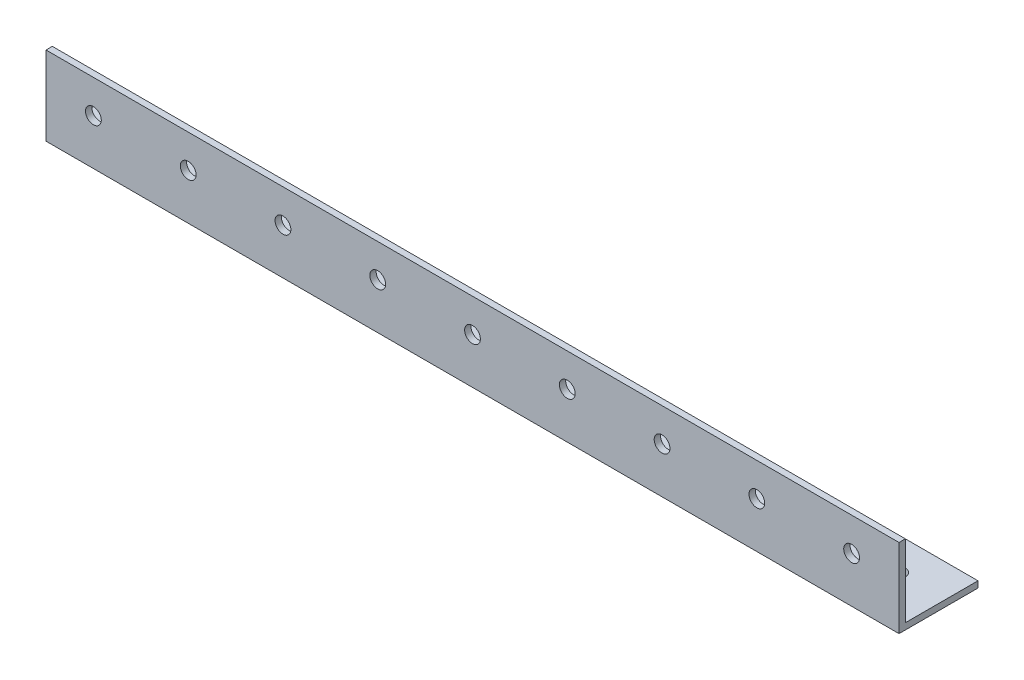
ISO-10303-21;
HEADER;
FILE_DESCRIPTION(('STEP AP214'),'2;1');
FILE_NAME('part.step','',(''),(''),'','','');
FILE_SCHEMA(('AUTOMOTIVE_DESIGN { 1 0 10303 214 1 1 1 1 }'));
ENDSEC;
DATA;
#1=APPLICATION_CONTEXT('core data for automotive mechanical design processes');
#2=APPLICATION_PROTOCOL_DEFINITION('international standard','automotive_design',2000,#1);
#3=PRODUCT_CONTEXT('',#1,'mechanical');
#4=PRODUCT('Part','Part','',(#3));
#5=PRODUCT_RELATED_PRODUCT_CATEGORY('part','',(#4));
#6=PRODUCT_DEFINITION_FORMATION('','',#4);
#7=PRODUCT_DEFINITION_CONTEXT('part definition',#1,'design');
#8=PRODUCT_DEFINITION('design','',#6,#7);
#9=PRODUCT_DEFINITION_SHAPE('','',#8);
#10=(LENGTH_UNIT() NAMED_UNIT(*) SI_UNIT(.MILLI.,.METRE.));
#11=(NAMED_UNIT(*) PLANE_ANGLE_UNIT() SI_UNIT($,.RADIAN.));
#12=(NAMED_UNIT(*) SI_UNIT($,.STERADIAN.) SOLID_ANGLE_UNIT());
#13=UNCERTAINTY_MEASURE_WITH_UNIT(LENGTH_MEASURE(1.E-05),#10,'distance_accuracy_value','');
#14=(GEOMETRIC_REPRESENTATION_CONTEXT(3) GLOBAL_UNCERTAINTY_ASSIGNED_CONTEXT((#13)) GLOBAL_UNIT_ASSIGNED_CONTEXT((#10,
#11,#12)) REPRESENTATION_CONTEXT('',''));
#15=CARTESIAN_POINT('',(0.,0.,0.));
#16=DIRECTION('',(0.,0.,1.));
#17=DIRECTION('',(1.,0.,0.));
#18=AXIS2_PLACEMENT_3D('',#15,#16,#17);
#19=CARTESIAN_POINT('',(539.999999999999,0.,0.));
#20=DIRECTION('',(0.,1.,0.));
#21=DIRECTION('',(0.,0.,1.));
#22=AXIS2_PLACEMENT_3D('',#19,#20,#21);
#23=PLANE('',#22);
#24=CARTESIAN_POINT('',(30.,0.,-29.));
#25=DIRECTION('',(0.,-1.,0.));
#26=DIRECTION('',(0.,0.,-1.));
#27=AXIS2_PLACEMENT_3D('',#24,#25,#26);
#28=CIRCLE('',#27,5.);
#29=CARTESIAN_POINT('',(30.,0.,-34.));
#30=VERTEX_POINT('',#29);
#31=EDGE_CURVE('E142',#30,#30,#28,.T.);
#32=ORIENTED_EDGE('',*,*,#31,.F.);
#33=EDGE_LOOP('',(#32));
#34=FACE_BOUND('',#33,.T.);
#35=CARTESIAN_POINT('',(90.,0.,-29.));
#36=DIRECTION('',(0.,-1.,0.));
#37=DIRECTION('',(0.,0.,-1.));
#38=AXIS2_PLACEMENT_3D('',#35,#36,#37);
#39=CIRCLE('',#38,5.);
#40=CARTESIAN_POINT('',(90.,0.,-34.));
#41=VERTEX_POINT('',#40);
#42=EDGE_CURVE('E258',#41,#41,#39,.T.);
#43=ORIENTED_EDGE('',*,*,#42,.F.);
#44=EDGE_LOOP('',(#43));
#45=FACE_BOUND('',#44,.T.);
#46=CARTESIAN_POINT('',(150.,0.,-29.));
#47=DIRECTION('',(0.,-1.,0.));
#48=DIRECTION('',(0.,0.,-1.));
#49=AXIS2_PLACEMENT_3D('',#46,#47,#48);
#50=CIRCLE('',#49,4.99999999999999);
#51=CARTESIAN_POINT('',(150.,0.,-34.));
#52=VERTEX_POINT('',#51);
#53=EDGE_CURVE('E262',#52,#52,#50,.T.);
#54=ORIENTED_EDGE('',*,*,#53,.F.);
#55=EDGE_LOOP('',(#54));
#56=FACE_BOUND('',#55,.T.);
#57=CARTESIAN_POINT('',(210.,0.,-29.));
#58=DIRECTION('',(0.,-1.,0.));
#59=DIRECTION('',(0.,0.,-1.));
#60=AXIS2_PLACEMENT_3D('',#57,#58,#59);
#61=CIRCLE('',#60,5.00000000000002);
#62=CARTESIAN_POINT('',(210.,0.,-34.));
#63=VERTEX_POINT('',#62);
#64=EDGE_CURVE('E266',#63,#63,#61,.T.);
#65=ORIENTED_EDGE('',*,*,#64,.F.);
#66=EDGE_LOOP('',(#65));
#67=FACE_BOUND('',#66,.T.);
#68=CARTESIAN_POINT('',(270.,0.,-29.));
#69=DIRECTION('',(0.,-1.,0.));
#70=DIRECTION('',(0.,0.,-1.));
#71=AXIS2_PLACEMENT_3D('',#68,#69,#70);
#72=CIRCLE('',#71,4.99999999999999);
#73=CARTESIAN_POINT('',(270.,0.,-34.));
#74=VERTEX_POINT('',#73);
#75=EDGE_CURVE('E270',#74,#74,#72,.T.);
#76=ORIENTED_EDGE('',*,*,#75,.F.);
#77=EDGE_LOOP('',(#76));
#78=FACE_BOUND('',#77,.T.);
#79=CARTESIAN_POINT('',(330.,0.,-29.));
#80=DIRECTION('',(0.,-1.,0.));
#81=DIRECTION('',(0.,0.,-1.));
#82=AXIS2_PLACEMENT_3D('',#79,#80,#81);
#83=CIRCLE('',#82,5.00000000000005);
#84=CARTESIAN_POINT('',(330.,0.,-34.));
#85=VERTEX_POINT('',#84);
#86=EDGE_CURVE('E274',#85,#85,#83,.T.);
#87=ORIENTED_EDGE('',*,*,#86,.F.);
#88=EDGE_LOOP('',(#87));
#89=FACE_BOUND('',#88,.T.);
#90=CARTESIAN_POINT('',(390.,0.,-29.));
#91=DIRECTION('',(0.,-1.,0.));
#92=DIRECTION('',(0.,0.,-1.));
#93=AXIS2_PLACEMENT_3D('',#90,#91,#92);
#94=CIRCLE('',#93,4.99999999999999);
#95=CARTESIAN_POINT('',(390.,0.,-34.));
#96=VERTEX_POINT('',#95);
#97=EDGE_CURVE('E278',#96,#96,#94,.T.);
#98=ORIENTED_EDGE('',*,*,#97,.F.);
#99=EDGE_LOOP('',(#98));
#100=FACE_BOUND('',#99,.T.);
#101=CARTESIAN_POINT('',(450.,0.,-29.));
#102=DIRECTION('',(0.,-1.,0.));
#103=DIRECTION('',(0.,0.,-1.));
#104=AXIS2_PLACEMENT_3D('',#101,#102,#103);
#105=CIRCLE('',#104,5.00000000000005);
#106=CARTESIAN_POINT('',(450.,0.,-34.));
#107=VERTEX_POINT('',#106);
#108=EDGE_CURVE('E282',#107,#107,#105,.T.);
#109=ORIENTED_EDGE('',*,*,#108,.F.);
#110=EDGE_LOOP('',(#109));
#111=FACE_BOUND('',#110,.T.);
#112=CARTESIAN_POINT('',(510.,0.,-29.));
#113=DIRECTION('',(0.,-1.,0.));
#114=DIRECTION('',(0.,0.,-1.));
#115=AXIS2_PLACEMENT_3D('',#112,#113,#114);
#116=CIRCLE('',#115,4.99999999999993);
#117=CARTESIAN_POINT('',(510.,0.,-33.9999999999999));
#118=VERTEX_POINT('',#117);
#119=EDGE_CURVE('E285',#118,#118,#116,.T.);
#120=ORIENTED_EDGE('',*,*,#119,.F.);
#121=EDGE_LOOP('',(#120));
#122=FACE_BOUND('',#121,.T.);
#123=DIRECTION('',(0.,0.,-1.));
#124=VECTOR('',#123,1.);
#125=CARTESIAN_POINT('',(0.,0.,0.));
#126=LINE('',#125,#124);
#127=CARTESIAN_POINT('',(0.,0.,0.));
#128=VERTEX_POINT('',#127);
#129=CARTESIAN_POINT('',(0.,0.,-50.));
#130=VERTEX_POINT('',#129);
#131=EDGE_CURVE('E120',#128,#130,#126,.T.);
#132=ORIENTED_EDGE('',*,*,#131,.T.);
#133=DIRECTION('',(-1.,0.,0.));
#134=VECTOR('',#133,1.);
#135=CARTESIAN_POINT('',(539.999999999999,0.,-50.));
#136=LINE('',#135,#134);
#137=CARTESIAN_POINT('',(539.999999999999,0.,-50.));
#138=VERTEX_POINT('',#137);
#139=EDGE_CURVE('E11',#138,#130,#136,.T.);
#140=ORIENTED_EDGE('',*,*,#139,.F.);
#141=DIRECTION('',(0.,0.,-1.));
#142=VECTOR('',#141,1.);
#143=CARTESIAN_POINT('',(539.999999999999,0.,0.));
#144=LINE('',#143,#142);
#145=CARTESIAN_POINT('',(539.999999999999,0.,0.));
#146=VERTEX_POINT('',#145);
#147=EDGE_CURVE('E85',#146,#138,#144,.T.);
#148=ORIENTED_EDGE('',*,*,#147,.F.);
#149=DIRECTION('',(-1.,0.,0.));
#150=VECTOR('',#149,1.);
#151=CARTESIAN_POINT('',(539.999999999999,0.,0.));
#152=LINE('',#151,#150);
#153=EDGE_CURVE('E116',#146,#128,#152,.T.);
#154=ORIENTED_EDGE('',*,*,#153,.T.);
#155=EDGE_LOOP('',(#132,#140,#148,#154));
#156=FACE_BOUND('',#155,.T.);
#157=ADVANCED_FACE('F37',(#34,#45,#56,#67,#78,#89,#100,#111,#122,#156),#23,.F.);
#158=CARTESIAN_POINT('',(539.999999999999,4.,-50.));
#159=DIRECTION('',(0.,0.,-1.));
#160=DIRECTION('',(-1.,0.,0.));
#161=AXIS2_PLACEMENT_3D('',#158,#159,#160);
#162=PLANE('',#161);
#163=DIRECTION('',(0.,-1.,0.));
#164=VECTOR('',#163,1.);
#165=CARTESIAN_POINT('',(0.,4.,-50.));
#166=LINE('',#165,#164);
#167=CARTESIAN_POINT('',(0.,4.,-50.));
#168=VERTEX_POINT('',#167);
#169=EDGE_CURVE('E123',#168,#130,#166,.T.);
#170=ORIENTED_EDGE('',*,*,#169,.F.);
#171=DIRECTION('',(-1.,0.,0.));
#172=VECTOR('',#171,1.);
#173=CARTESIAN_POINT('',(539.999999999999,4.,-50.));
#174=LINE('',#173,#172);
#175=CARTESIAN_POINT('',(539.999999999999,4.,-50.));
#176=VERTEX_POINT('',#175);
#177=EDGE_CURVE('E46',#176,#168,#174,.T.);
#178=ORIENTED_EDGE('',*,*,#177,.F.);
#179=DIRECTION('',(0.,-1.,0.));
#180=VECTOR('',#179,1.);
#181=CARTESIAN_POINT('',(539.999999999999,4.,-50.));
#182=LINE('',#181,#180);
#183=EDGE_CURVE('E222',#176,#138,#182,.T.);
#184=ORIENTED_EDGE('',*,*,#183,.T.);
#185=ORIENTED_EDGE('',*,*,#139,.T.);
#186=EDGE_LOOP('',(#170,#178,#184,#185));
#187=FACE_BOUND('',#186,.T.);
#188=ADVANCED_FACE('F246',(#187),#162,.T.);
#189=CARTESIAN_POINT('',(539.999999999999,4.,0.));
#190=DIRECTION('',(0.,1.,0.));
#191=DIRECTION('',(0.,0.,1.));
#192=AXIS2_PLACEMENT_3D('',#189,#190,#191);
#193=PLANE('',#192);
#194=CARTESIAN_POINT('',(30.,4.,-29.));
#195=DIRECTION('',(0.,1.,0.));
#196=DIRECTION('',(0.,0.,1.));
#197=AXIS2_PLACEMENT_3D('',#194,#195,#196);
#198=CIRCLE('',#197,5.);
#199=CARTESIAN_POINT('',(30.,4.,-24.));
#200=VERTEX_POINT('',#199);
#201=EDGE_CURVE('E40',#200,#200,#198,.T.);
#202=ORIENTED_EDGE('',*,*,#201,.F.);
#203=EDGE_LOOP('',(#202));
#204=FACE_BOUND('',#203,.T.);
#205=CARTESIAN_POINT('',(90.,4.,-29.));
#206=DIRECTION('',(0.,1.,0.));
#207=DIRECTION('',(0.,0.,1.));
#208=AXIS2_PLACEMENT_3D('',#205,#206,#207);
#209=CIRCLE('',#208,5.);
#210=CARTESIAN_POINT('',(90.,4.,-24.));
#211=VERTEX_POINT('',#210);
#212=EDGE_CURVE('E159',#211,#211,#209,.T.);
#213=ORIENTED_EDGE('',*,*,#212,.F.);
#214=EDGE_LOOP('',(#213));
#215=FACE_BOUND('',#214,.T.);
#216=CARTESIAN_POINT('',(150.,4.,-29.));
#217=DIRECTION('',(0.,1.,0.));
#218=DIRECTION('',(0.,0.,1.));
#219=AXIS2_PLACEMENT_3D('',#216,#217,#218);
#220=CIRCLE('',#219,4.99999999999999);
#221=CARTESIAN_POINT('',(150.,4.,-24.));
#222=VERTEX_POINT('',#221);
#223=EDGE_CURVE('E157',#222,#222,#220,.T.);
#224=ORIENTED_EDGE('',*,*,#223,.F.);
#225=EDGE_LOOP('',(#224));
#226=FACE_BOUND('',#225,.T.);
#227=CARTESIAN_POINT('',(210.,4.,-29.));
#228=DIRECTION('',(0.,1.,0.));
#229=DIRECTION('',(0.,0.,1.));
#230=AXIS2_PLACEMENT_3D('',#227,#228,#229);
#231=CIRCLE('',#230,5.00000000000002);
#232=CARTESIAN_POINT('',(210.,4.,-24.));
#233=VERTEX_POINT('',#232);
#234=EDGE_CURVE('E154',#233,#233,#231,.T.);
#235=ORIENTED_EDGE('',*,*,#234,.F.);
#236=EDGE_LOOP('',(#235));
#237=FACE_BOUND('',#236,.T.);
#238=CARTESIAN_POINT('',(270.,4.,-29.));
#239=DIRECTION('',(0.,1.,0.));
#240=DIRECTION('',(0.,0.,1.));
#241=AXIS2_PLACEMENT_3D('',#238,#239,#240);
#242=CIRCLE('',#241,4.99999999999999);
#243=CARTESIAN_POINT('',(270.,4.,-24.));
#244=VERTEX_POINT('',#243);
#245=EDGE_CURVE('E151',#244,#244,#242,.T.);
#246=ORIENTED_EDGE('',*,*,#245,.F.);
#247=EDGE_LOOP('',(#246));
#248=FACE_BOUND('',#247,.T.);
#249=CARTESIAN_POINT('',(330.,4.,-29.));
#250=DIRECTION('',(0.,1.,0.));
#251=DIRECTION('',(0.,0.,1.));
#252=AXIS2_PLACEMENT_3D('',#249,#250,#251);
#253=CIRCLE('',#252,5.00000000000005);
#254=CARTESIAN_POINT('',(330.,4.,-24.));
#255=VERTEX_POINT('',#254);
#256=EDGE_CURVE('E148',#255,#255,#253,.T.);
#257=ORIENTED_EDGE('',*,*,#256,.F.);
#258=EDGE_LOOP('',(#257));
#259=FACE_BOUND('',#258,.T.);
#260=CARTESIAN_POINT('',(390.,4.,-29.));
#261=DIRECTION('',(0.,1.,0.));
#262=DIRECTION('',(0.,0.,1.));
#263=AXIS2_PLACEMENT_3D('',#260,#261,#262);
#264=CIRCLE('',#263,4.99999999999999);
#265=CARTESIAN_POINT('',(390.,4.,-24.));
#266=VERTEX_POINT('',#265);
#267=EDGE_CURVE('E145',#266,#266,#264,.T.);
#268=ORIENTED_EDGE('',*,*,#267,.F.);
#269=EDGE_LOOP('',(#268));
#270=FACE_BOUND('',#269,.T.);
#271=CARTESIAN_POINT('',(450.,4.,-29.));
#272=DIRECTION('',(0.,1.,0.));
#273=DIRECTION('',(0.,0.,1.));
#274=AXIS2_PLACEMENT_3D('',#271,#272,#273);
#275=CIRCLE('',#274,5.00000000000005);
#276=CARTESIAN_POINT('',(450.,4.,-24.));
#277=VERTEX_POINT('',#276);
#278=EDGE_CURVE('E141',#277,#277,#275,.T.);
#279=ORIENTED_EDGE('',*,*,#278,.F.);
#280=EDGE_LOOP('',(#279));
#281=FACE_BOUND('',#280,.T.);
#282=CARTESIAN_POINT('',(510.,4.,-29.));
#283=DIRECTION('',(0.,1.,0.));
#284=DIRECTION('',(0.,0.,1.));
#285=AXIS2_PLACEMENT_3D('',#282,#283,#284);
#286=CIRCLE('',#285,4.99999999999993);
#287=CARTESIAN_POINT('',(510.,4.,-24.0000000000001));
#288=VERTEX_POINT('',#287);
#289=EDGE_CURVE('E138',#288,#288,#286,.T.);
#290=ORIENTED_EDGE('',*,*,#289,.F.);
#291=EDGE_LOOP('',(#290));
#292=FACE_BOUND('',#291,.T.);
#293=DIRECTION('',(0.,0.,-1.));
#294=VECTOR('',#293,1.);
#295=CARTESIAN_POINT('',(0.,4.,0.));
#296=LINE('',#295,#294);
#297=CARTESIAN_POINT('',(0.,4.,-4.));
#298=VERTEX_POINT('',#297);
#299=EDGE_CURVE('E127',#298,#168,#296,.T.);
#300=ORIENTED_EDGE('',*,*,#299,.F.);
#301=DIRECTION('',(-1.,0.,0.));
#302=VECTOR('',#301,1.);
#303=CARTESIAN_POINT('',(539.999999999999,4.,-4.));
#304=LINE('',#303,#302);
#305=CARTESIAN_POINT('',(539.999999999999,4.,-4.));
#306=VERTEX_POINT('',#305);
#307=EDGE_CURVE('E106',#306,#298,#304,.T.);
#308=ORIENTED_EDGE('',*,*,#307,.F.);
#309=DIRECTION('',(0.,0.,-1.));
#310=VECTOR('',#309,1.);
#311=CARTESIAN_POINT('',(539.999999999999,4.,0.));
#312=LINE('',#311,#310);
#313=EDGE_CURVE('E112',#306,#176,#312,.T.);
#314=ORIENTED_EDGE('',*,*,#313,.T.);
#315=ORIENTED_EDGE('',*,*,#177,.T.);
#316=EDGE_LOOP('',(#300,#308,#314,#315));
#317=FACE_BOUND('',#316,.T.);
#318=ADVANCED_FACE('F226',(#204,#215,#226,#237,#248,#259,#270,#281,#292,#317),#193,.T.);
#319=CARTESIAN_POINT('',(539.999999999999,0.,-4.));
#320=DIRECTION('',(0.,0.,-1.));
#321=DIRECTION('',(-1.,0.,0.));
#322=AXIS2_PLACEMENT_3D('',#319,#320,#321);
#323=PLANE('',#322);
#324=CARTESIAN_POINT('',(29.9999999999998,29.,-4.));
#325=DIRECTION('',(0.,0.,-1.));
#326=DIRECTION('',(-1.,0.,0.));
#327=AXIS2_PLACEMENT_3D('',#324,#325,#326);
#328=CIRCLE('',#327,4.99999999999998);
#329=CARTESIAN_POINT('',(24.9999999999998,29.,-4.));
#330=VERTEX_POINT('',#329);
#331=EDGE_CURVE('E124',#330,#330,#328,.T.);
#332=ORIENTED_EDGE('',*,*,#331,.F.);
#333=EDGE_LOOP('',(#332));
#334=FACE_BOUND('',#333,.T.);
#335=CARTESIAN_POINT('',(389.999999999999,29.,-4.));
#336=DIRECTION('',(0.,0.,-1.));
#337=DIRECTION('',(-1.,0.,0.));
#338=AXIS2_PLACEMENT_3D('',#335,#336,#337);
#339=CIRCLE('',#338,4.99999999999999);
#340=CARTESIAN_POINT('',(384.999999999999,29.,-4.));
#341=VERTEX_POINT('',#340);
#342=EDGE_CURVE('E216',#341,#341,#339,.T.);
#343=ORIENTED_EDGE('',*,*,#342,.F.);
#344=EDGE_LOOP('',(#343));
#345=FACE_BOUND('',#344,.T.);
#346=CARTESIAN_POINT('',(449.999999999999,29.,-4.));
#347=DIRECTION('',(0.,0.,-1.));
#348=DIRECTION('',(-1.,0.,0.));
#349=AXIS2_PLACEMENT_3D('',#346,#347,#348);
#350=CIRCLE('',#349,4.99999999999999);
#351=CARTESIAN_POINT('',(444.999999999999,29.,-4.));
#352=VERTEX_POINT('',#351);
#353=EDGE_CURVE('E213',#352,#352,#350,.T.);
#354=ORIENTED_EDGE('',*,*,#353,.F.);
#355=EDGE_LOOP('',(#354));
#356=FACE_BOUND('',#355,.T.);
#357=CARTESIAN_POINT('',(509.999999999999,29.,-4.));
#358=DIRECTION('',(0.,0.,-1.));
#359=DIRECTION('',(-1.,0.,0.));
#360=AXIS2_PLACEMENT_3D('',#357,#358,#359);
#361=CIRCLE('',#360,4.99999999999993);
#362=CARTESIAN_POINT('',(504.999999999999,29.,-4.));
#363=VERTEX_POINT('',#362);
#364=EDGE_CURVE('E210',#363,#363,#361,.T.);
#365=ORIENTED_EDGE('',*,*,#364,.F.);
#366=EDGE_LOOP('',(#365));
#367=FACE_BOUND('',#366,.T.);
#368=CARTESIAN_POINT('',(269.999999999999,29.,-4.));
#369=DIRECTION('',(0.,0.,-1.));
#370=DIRECTION('',(-1.,0.,0.));
#371=AXIS2_PLACEMENT_3D('',#368,#369,#370);
#372=CIRCLE('',#371,4.99999999999999);
#373=CARTESIAN_POINT('',(264.999999999999,29.,-4.));
#374=VERTEX_POINT('',#373);
#375=EDGE_CURVE('E207',#374,#374,#372,.T.);
#376=ORIENTED_EDGE('',*,*,#375,.F.);
#377=EDGE_LOOP('',(#376));
#378=FACE_BOUND('',#377,.T.);
#379=CARTESIAN_POINT('',(329.999999999999,29.,-4.));
#380=DIRECTION('',(0.,0.,-1.));
#381=DIRECTION('',(-1.,0.,0.));
#382=AXIS2_PLACEMENT_3D('',#379,#380,#381);
#383=CIRCLE('',#382,4.99999999999999);
#384=CARTESIAN_POINT('',(324.999999999999,29.,-4.));
#385=VERTEX_POINT('',#384);
#386=EDGE_CURVE('E204',#385,#385,#383,.T.);
#387=ORIENTED_EDGE('',*,*,#386,.F.);
#388=EDGE_LOOP('',(#387));
#389=FACE_BOUND('',#388,.T.);
#390=CARTESIAN_POINT('',(209.999999999999,29.,-4.));
#391=DIRECTION('',(0.,0.,-1.));
#392=DIRECTION('',(-1.,0.,0.));
#393=AXIS2_PLACEMENT_3D('',#390,#391,#392);
#394=CIRCLE('',#393,5.00000000000008);
#395=CARTESIAN_POINT('',(204.999999999999,29.,-4.));
#396=VERTEX_POINT('',#395);
#397=EDGE_CURVE('E201',#396,#396,#394,.T.);
#398=ORIENTED_EDGE('',*,*,#397,.F.);
#399=EDGE_LOOP('',(#398));
#400=FACE_BOUND('',#399,.T.);
#401=CARTESIAN_POINT('',(150.,29.,-4.));
#402=DIRECTION('',(0.,0.,-1.));
#403=DIRECTION('',(-1.,0.,0.));
#404=AXIS2_PLACEMENT_3D('',#401,#402,#403);
#405=CIRCLE('',#404,5.00000000000005);
#406=CARTESIAN_POINT('',(145.,29.,-4.));
#407=VERTEX_POINT('',#406);
#408=EDGE_CURVE('E198',#407,#407,#405,.T.);
#409=ORIENTED_EDGE('',*,*,#408,.F.);
#410=EDGE_LOOP('',(#409));
#411=FACE_BOUND('',#410,.T.);
#412=CARTESIAN_POINT('',(89.9999999999997,29.,-4.));
#413=DIRECTION('',(0.,0.,-1.));
#414=DIRECTION('',(-1.,0.,0.));
#415=AXIS2_PLACEMENT_3D('',#412,#413,#414);
#416=CIRCLE('',#415,4.99999999999999);
#417=CARTESIAN_POINT('',(84.9999999999997,29.,-4.));
#418=VERTEX_POINT('',#417);
#419=EDGE_CURVE('E195',#418,#418,#416,.T.);
#420=ORIENTED_EDGE('',*,*,#419,.F.);
#421=EDGE_LOOP('',(#420));
#422=FACE_BOUND('',#421,.T.);
#423=DIRECTION('',(0.,1.,0.));
#424=VECTOR('',#423,1.);
#425=CARTESIAN_POINT('',(0.,0.,-4.));
#426=LINE('',#425,#424);
#427=CARTESIAN_POINT('',(0.,50.,-4.));
#428=VERTEX_POINT('',#427);
#429=EDGE_CURVE('E101',#428,#298,#426,.F.);
#430=ORIENTED_EDGE('',*,*,#429,.F.);
#431=DIRECTION('',(-1.,0.,0.));
#432=VECTOR('',#431,1.);
#433=CARTESIAN_POINT('',(539.999999999999,50.,-4.));
#434=LINE('',#433,#432);
#435=CARTESIAN_POINT('',(539.999999999999,50.,-4.));
#436=VERTEX_POINT('',#435);
#437=EDGE_CURVE('E96',#436,#428,#434,.T.);
#438=ORIENTED_EDGE('',*,*,#437,.F.);
#439=DIRECTION('',(0.,1.,0.));
#440=VECTOR('',#439,1.);
#441=CARTESIAN_POINT('',(539.999999999999,0.,-4.));
#442=LINE('',#441,#440);
#443=EDGE_CURVE('E99',#436,#306,#442,.F.);
#444=ORIENTED_EDGE('',*,*,#443,.T.);
#445=ORIENTED_EDGE('',*,*,#307,.T.);
#446=EDGE_LOOP('',(#430,#438,#444,#445));
#447=FACE_BOUND('',#446,.T.);
#448=ADVANCED_FACE('F98',(#334,#345,#356,#367,#378,#389,#400,#411,#422,#447),#323,.T.);
#449=CARTESIAN_POINT('',(539.999999999999,50.,0.));
#450=DIRECTION('',(0.,1.,0.));
#451=DIRECTION('',(0.,0.,1.));
#452=AXIS2_PLACEMENT_3D('',#449,#450,#451);
#453=PLANE('',#452);
#454=DIRECTION('',(0.,0.,-1.));
#455=VECTOR('',#454,1.);
#456=CARTESIAN_POINT('',(0.,50.,0.));
#457=LINE('',#456,#455);
#458=CARTESIAN_POINT('',(0.,50.,0.));
#459=VERTEX_POINT('',#458);
#460=EDGE_CURVE('E131',#459,#428,#457,.T.);
#461=ORIENTED_EDGE('',*,*,#460,.F.);
#462=DIRECTION('',(-1.,0.,0.));
#463=VECTOR('',#462,1.);
#464=CARTESIAN_POINT('',(539.999999999999,50.,0.));
#465=LINE('',#464,#463);
#466=CARTESIAN_POINT('',(539.999999999999,50.,0.));
#467=VERTEX_POINT('',#466);
#468=EDGE_CURVE('E76',#467,#459,#465,.T.);
#469=ORIENTED_EDGE('',*,*,#468,.F.);
#470=DIRECTION('',(0.,0.,-1.));
#471=VECTOR('',#470,1.);
#472=CARTESIAN_POINT('',(539.999999999999,50.,0.));
#473=LINE('',#472,#471);
#474=EDGE_CURVE('E110',#467,#436,#473,.T.);
#475=ORIENTED_EDGE('',*,*,#474,.T.);
#476=ORIENTED_EDGE('',*,*,#437,.T.);
#477=EDGE_LOOP('',(#461,#469,#475,#476));
#478=FACE_BOUND('',#477,.T.);
#479=ADVANCED_FACE('F114',(#478),#453,.T.);
#480=CARTESIAN_POINT('',(539.999999999999,0.,0.));
#481=DIRECTION('',(0.,0.,-1.));
#482=DIRECTION('',(-1.,0.,0.));
#483=AXIS2_PLACEMENT_3D('',#480,#481,#482);
#484=PLANE('',#483);
#485=CARTESIAN_POINT('',(29.9999999999998,29.,0.));
#486=DIRECTION('',(0.,0.,1.));
#487=DIRECTION('',(1.,0.,0.));
#488=AXIS2_PLACEMENT_3D('',#485,#486,#487);
#489=CIRCLE('',#488,4.99999999999998);
#490=CARTESIAN_POINT('',(34.9999999999998,29.,0.));
#491=VERTEX_POINT('',#490);
#492=EDGE_CURVE('E186',#491,#491,#489,.T.);
#493=ORIENTED_EDGE('',*,*,#492,.F.);
#494=EDGE_LOOP('',(#493));
#495=FACE_BOUND('',#494,.T.);
#496=CARTESIAN_POINT('',(389.999999999999,29.,0.));
#497=DIRECTION('',(0.,0.,1.));
#498=DIRECTION('',(1.,0.,0.));
#499=AXIS2_PLACEMENT_3D('',#496,#497,#498);
#500=CIRCLE('',#499,4.99999999999999);
#501=CARTESIAN_POINT('',(394.999999999999,29.,0.));
#502=VERTEX_POINT('',#501);
#503=EDGE_CURVE('E177',#502,#502,#500,.T.);
#504=ORIENTED_EDGE('',*,*,#503,.F.);
#505=EDGE_LOOP('',(#504));
#506=FACE_BOUND('',#505,.T.);
#507=CARTESIAN_POINT('',(449.999999999999,29.,0.));
#508=DIRECTION('',(0.,0.,1.));
#509=DIRECTION('',(1.,0.,0.));
#510=AXIS2_PLACEMENT_3D('',#507,#508,#509);
#511=CIRCLE('',#510,4.99999999999999);
#512=CARTESIAN_POINT('',(454.999999999999,29.,0.));
#513=VERTEX_POINT('',#512);
#514=EDGE_CURVE('E173',#513,#513,#511,.T.);
#515=ORIENTED_EDGE('',*,*,#514,.F.);
#516=EDGE_LOOP('',(#515));
#517=FACE_BOUND('',#516,.T.);
#518=CARTESIAN_POINT('',(509.999999999999,29.,0.));
#519=DIRECTION('',(0.,0.,1.));
#520=DIRECTION('',(1.,0.,0.));
#521=AXIS2_PLACEMENT_3D('',#518,#519,#520);
#522=CIRCLE('',#521,4.99999999999993);
#523=CARTESIAN_POINT('',(514.999999999999,29.,0.));
#524=VERTEX_POINT('',#523);
#525=EDGE_CURVE('E168',#524,#524,#522,.T.);
#526=ORIENTED_EDGE('',*,*,#525,.F.);
#527=EDGE_LOOP('',(#526));
#528=FACE_BOUND('',#527,.T.);
#529=CARTESIAN_POINT('',(269.999999999999,29.,0.));
#530=DIRECTION('',(0.,0.,1.));
#531=DIRECTION('',(1.,0.,0.));
#532=AXIS2_PLACEMENT_3D('',#529,#530,#531);
#533=CIRCLE('',#532,4.99999999999999);
#534=CARTESIAN_POINT('',(274.999999999999,29.,0.));
#535=VERTEX_POINT('',#534);
#536=EDGE_CURVE('E164',#535,#535,#533,.T.);
#537=ORIENTED_EDGE('',*,*,#536,.F.);
#538=EDGE_LOOP('',(#537));
#539=FACE_BOUND('',#538,.T.);
#540=CARTESIAN_POINT('',(329.999999999999,29.,0.));
#541=DIRECTION('',(0.,0.,1.));
#542=DIRECTION('',(1.,0.,0.));
#543=AXIS2_PLACEMENT_3D('',#540,#541,#542);
#544=CIRCLE('',#543,4.99999999999999);
#545=CARTESIAN_POINT('',(334.999999999999,29.,0.));
#546=VERTEX_POINT('',#545);
#547=EDGE_CURVE('E180',#546,#546,#544,.T.);
#548=ORIENTED_EDGE('',*,*,#547,.F.);
#549=EDGE_LOOP('',(#548));
#550=FACE_BOUND('',#549,.T.);
#551=CARTESIAN_POINT('',(209.999999999999,29.,0.));
#552=DIRECTION('',(0.,0.,1.));
#553=DIRECTION('',(1.,0.,0.));
#554=AXIS2_PLACEMENT_3D('',#551,#552,#553);
#555=CIRCLE('',#554,5.00000000000008);
#556=CARTESIAN_POINT('',(215.,29.,0.));
#557=VERTEX_POINT('',#556);
#558=EDGE_CURVE('E190',#557,#557,#555,.T.);
#559=ORIENTED_EDGE('',*,*,#558,.F.);
#560=EDGE_LOOP('',(#559));
#561=FACE_BOUND('',#560,.T.);
#562=CARTESIAN_POINT('',(150.,29.,0.));
#563=DIRECTION('',(0.,0.,1.));
#564=DIRECTION('',(1.,0.,0.));
#565=AXIS2_PLACEMENT_3D('',#562,#563,#564);
#566=CIRCLE('',#565,5.00000000000005);
#567=CARTESIAN_POINT('',(155.,29.,0.));
#568=VERTEX_POINT('',#567);
#569=EDGE_CURVE('E187',#568,#568,#566,.T.);
#570=ORIENTED_EDGE('',*,*,#569,.F.);
#571=EDGE_LOOP('',(#570));
#572=FACE_BOUND('',#571,.T.);
#573=CARTESIAN_POINT('',(89.9999999999997,29.,0.));
#574=DIRECTION('',(0.,0.,1.));
#575=DIRECTION('',(1.,0.,0.));
#576=AXIS2_PLACEMENT_3D('',#573,#574,#575);
#577=CIRCLE('',#576,4.99999999999999);
#578=CARTESIAN_POINT('',(94.9999999999997,29.,0.));
#579=VERTEX_POINT('',#578);
#580=EDGE_CURVE('E183',#579,#579,#577,.T.);
#581=ORIENTED_EDGE('',*,*,#580,.F.);
#582=EDGE_LOOP('',(#581));
#583=FACE_BOUND('',#582,.T.);
#584=DIRECTION('',(0.,-1.,0.));
#585=VECTOR('',#584,1.);
#586=CARTESIAN_POINT('',(0.,0.,0.));
#587=LINE('',#586,#585);
#588=EDGE_CURVE('E79',#459,#128,#587,.T.);
#589=ORIENTED_EDGE('',*,*,#588,.T.);
#590=ORIENTED_EDGE('',*,*,#153,.F.);
#591=DIRECTION('',(0.,-1.,0.));
#592=VECTOR('',#591,1.);
#593=CARTESIAN_POINT('',(539.999999999999,0.,0.));
#594=LINE('',#593,#592);
#595=EDGE_CURVE('E55',#467,#146,#594,.T.);
#596=ORIENTED_EDGE('',*,*,#595,.F.);
#597=ORIENTED_EDGE('',*,*,#468,.T.);
#598=EDGE_LOOP('',(#589,#590,#596,#597));
#599=FACE_BOUND('',#598,.T.);
#600=ADVANCED_FACE('F232',(#495,#506,#517,#528,#539,#550,#561,#572,#583,#599),#484,.F.);
#601=CARTESIAN_POINT('',(539.999999999999,0.,0.));
#602=DIRECTION('',(-1.,0.,0.));
#603=DIRECTION('',(0.,0.,1.));
#604=AXIS2_PLACEMENT_3D('',#601,#602,#603);
#605=PLANE('',#604);
#606=ORIENTED_EDGE('',*,*,#147,.T.);
#607=ORIENTED_EDGE('',*,*,#183,.F.);
#608=ORIENTED_EDGE('',*,*,#313,.F.);
#609=ORIENTED_EDGE('',*,*,#443,.F.);
#610=ORIENTED_EDGE('',*,*,#474,.F.);
#611=ORIENTED_EDGE('',*,*,#595,.T.);
#612=EDGE_LOOP('',(#606,#607,#608,#609,#610,#611));
#613=FACE_BOUND('',#612,.T.);
#614=ADVANCED_FACE('F109',(#613),#605,.F.);
#615=CARTESIAN_POINT('',(0.,0.,0.));
#616=DIRECTION('',(-1.,0.,0.));
#617=DIRECTION('',(0.,0.,1.));
#618=AXIS2_PLACEMENT_3D('',#615,#616,#617);
#619=PLANE('',#618);
#620=ORIENTED_EDGE('',*,*,#131,.F.);
#621=ORIENTED_EDGE('',*,*,#588,.F.);
#622=ORIENTED_EDGE('',*,*,#460,.T.);
#623=ORIENTED_EDGE('',*,*,#429,.T.);
#624=ORIENTED_EDGE('',*,*,#299,.T.);
#625=ORIENTED_EDGE('',*,*,#169,.T.);
#626=EDGE_LOOP('',(#620,#621,#622,#623,#624,#625));
#627=FACE_BOUND('',#626,.T.);
#628=ADVANCED_FACE('F230',(#627),#619,.T.);
#629=CARTESIAN_POINT('',(89.9999999999997,29.,-50.));
#630=DIRECTION('',(0.,0.,1.));
#631=DIRECTION('',(1.,0.,0.));
#632=AXIS2_PLACEMENT_3D('',#629,#630,#631);
#633=CYLINDRICAL_SURFACE('',#632,4.99999999999999);
#634=ORIENTED_EDGE('',*,*,#419,.T.);
#635=EDGE_LOOP('',(#634));
#636=FACE_BOUND('',#635,.T.);
#637=ORIENTED_EDGE('',*,*,#580,.T.);
#638=EDGE_LOOP('',(#637));
#639=FACE_BOUND('',#638,.T.);
#640=ADVANCED_FACE('F322',(#636,#639),#633,.F.);
#641=CARTESIAN_POINT('',(150.,29.,-50.));
#642=DIRECTION('',(0.,0.,1.));
#643=DIRECTION('',(1.,0.,0.));
#644=AXIS2_PLACEMENT_3D('',#641,#642,#643);
#645=CYLINDRICAL_SURFACE('',#644,5.00000000000005);
#646=ORIENTED_EDGE('',*,*,#408,.T.);
#647=EDGE_LOOP('',(#646));
#648=FACE_BOUND('',#647,.T.);
#649=ORIENTED_EDGE('',*,*,#569,.T.);
#650=EDGE_LOOP('',(#649));
#651=FACE_BOUND('',#650,.T.);
#652=ADVANCED_FACE('F325',(#648,#651),#645,.F.);
#653=CARTESIAN_POINT('',(209.999999999999,29.,-50.));
#654=DIRECTION('',(0.,0.,1.));
#655=DIRECTION('',(1.,0.,0.));
#656=AXIS2_PLACEMENT_3D('',#653,#654,#655);
#657=CYLINDRICAL_SURFACE('',#656,5.00000000000008);
#658=ORIENTED_EDGE('',*,*,#397,.T.);
#659=EDGE_LOOP('',(#658));
#660=FACE_BOUND('',#659,.T.);
#661=ORIENTED_EDGE('',*,*,#558,.T.);
#662=EDGE_LOOP('',(#661));
#663=FACE_BOUND('',#662,.T.);
#664=ADVANCED_FACE('F329',(#660,#663),#657,.F.);
#665=CARTESIAN_POINT('',(329.999999999999,29.,-50.));
#666=DIRECTION('',(0.,0.,1.));
#667=DIRECTION('',(1.,0.,0.));
#668=AXIS2_PLACEMENT_3D('',#665,#666,#667);
#669=CYLINDRICAL_SURFACE('',#668,4.99999999999999);
#670=ORIENTED_EDGE('',*,*,#386,.T.);
#671=EDGE_LOOP('',(#670));
#672=FACE_BOUND('',#671,.T.);
#673=ORIENTED_EDGE('',*,*,#547,.T.);
#674=EDGE_LOOP('',(#673));
#675=FACE_BOUND('',#674,.T.);
#676=ADVANCED_FACE('F316',(#672,#675),#669,.F.);
#677=CARTESIAN_POINT('',(269.999999999999,29.,-50.));
#678=DIRECTION('',(0.,0.,1.));
#679=DIRECTION('',(1.,0.,0.));
#680=AXIS2_PLACEMENT_3D('',#677,#678,#679);
#681=CYLINDRICAL_SURFACE('',#680,4.99999999999999);
#682=ORIENTED_EDGE('',*,*,#375,.T.);
#683=EDGE_LOOP('',(#682));
#684=FACE_BOUND('',#683,.T.);
#685=ORIENTED_EDGE('',*,*,#536,.T.);
#686=EDGE_LOOP('',(#685));
#687=FACE_BOUND('',#686,.T.);
#688=ADVANCED_FACE('F313',(#684,#687),#681,.F.);
#689=CARTESIAN_POINT('',(509.999999999999,29.,-50.));
#690=DIRECTION('',(0.,0.,1.));
#691=DIRECTION('',(1.,0.,0.));
#692=AXIS2_PLACEMENT_3D('',#689,#690,#691);
#693=CYLINDRICAL_SURFACE('',#692,4.99999999999993);
#694=ORIENTED_EDGE('',*,*,#364,.T.);
#695=EDGE_LOOP('',(#694));
#696=FACE_BOUND('',#695,.T.);
#697=ORIENTED_EDGE('',*,*,#525,.T.);
#698=EDGE_LOOP('',(#697));
#699=FACE_BOUND('',#698,.T.);
#700=ADVANCED_FACE('F310',(#696,#699),#693,.F.);
#701=CARTESIAN_POINT('',(449.999999999999,29.,-50.));
#702=DIRECTION('',(0.,0.,1.));
#703=DIRECTION('',(1.,0.,0.));
#704=AXIS2_PLACEMENT_3D('',#701,#702,#703);
#705=CYLINDRICAL_SURFACE('',#704,4.99999999999999);
#706=ORIENTED_EDGE('',*,*,#353,.T.);
#707=EDGE_LOOP('',(#706));
#708=FACE_BOUND('',#707,.T.);
#709=ORIENTED_EDGE('',*,*,#514,.T.);
#710=EDGE_LOOP('',(#709));
#711=FACE_BOUND('',#710,.T.);
#712=ADVANCED_FACE('F305',(#708,#711),#705,.F.);
#713=CARTESIAN_POINT('',(389.999999999999,29.,-50.));
#714=DIRECTION('',(0.,0.,1.));
#715=DIRECTION('',(1.,0.,0.));
#716=AXIS2_PLACEMENT_3D('',#713,#714,#715);
#717=CYLINDRICAL_SURFACE('',#716,4.99999999999999);
#718=ORIENTED_EDGE('',*,*,#342,.T.);
#719=EDGE_LOOP('',(#718));
#720=FACE_BOUND('',#719,.T.);
#721=ORIENTED_EDGE('',*,*,#503,.T.);
#722=EDGE_LOOP('',(#721));
#723=FACE_BOUND('',#722,.T.);
#724=ADVANCED_FACE('F295',(#720,#723),#717,.F.);
#725=CARTESIAN_POINT('',(29.9999999999998,29.,-50.));
#726=DIRECTION('',(0.,0.,1.));
#727=DIRECTION('',(1.,0.,0.));
#728=AXIS2_PLACEMENT_3D('',#725,#726,#727);
#729=CYLINDRICAL_SURFACE('',#728,4.99999999999998);
#730=ORIENTED_EDGE('',*,*,#331,.T.);
#731=EDGE_LOOP('',(#730));
#732=FACE_BOUND('',#731,.T.);
#733=ORIENTED_EDGE('',*,*,#492,.T.);
#734=EDGE_LOOP('',(#733));
#735=FACE_BOUND('',#734,.T.);
#736=ADVANCED_FACE('F292',(#732,#735),#729,.F.);
#737=CARTESIAN_POINT('',(510.,50.,-29.));
#738=DIRECTION('',(0.,-1.,0.));
#739=DIRECTION('',(0.,0.,-1.));
#740=AXIS2_PLACEMENT_3D('',#737,#738,#739);
#741=CYLINDRICAL_SURFACE('',#740,4.99999999999993);
#742=ORIENTED_EDGE('',*,*,#289,.T.);
#743=EDGE_LOOP('',(#742));
#744=FACE_BOUND('',#743,.T.);
#745=ORIENTED_EDGE('',*,*,#119,.T.);
#746=EDGE_LOOP('',(#745));
#747=FACE_BOUND('',#746,.T.);
#748=ADVANCED_FACE('F294',(#744,#747),#741,.F.);
#749=CARTESIAN_POINT('',(450.,50.,-29.));
#750=DIRECTION('',(0.,-1.,0.));
#751=DIRECTION('',(0.,0.,-1.));
#752=AXIS2_PLACEMENT_3D('',#749,#750,#751);
#753=CYLINDRICAL_SURFACE('',#752,5.00000000000005);
#754=ORIENTED_EDGE('',*,*,#278,.T.);
#755=EDGE_LOOP('',(#754));
#756=FACE_BOUND('',#755,.T.);
#757=ORIENTED_EDGE('',*,*,#108,.T.);
#758=EDGE_LOOP('',(#757));
#759=FACE_BOUND('',#758,.T.);
#760=ADVANCED_FACE('F302',(#756,#759),#753,.F.);
#761=CARTESIAN_POINT('',(390.,50.,-29.));
#762=DIRECTION('',(0.,-1.,0.));
#763=DIRECTION('',(0.,0.,-1.));
#764=AXIS2_PLACEMENT_3D('',#761,#762,#763);
#765=CYLINDRICAL_SURFACE('',#764,4.99999999999999);
#766=ORIENTED_EDGE('',*,*,#267,.T.);
#767=EDGE_LOOP('',(#766));
#768=FACE_BOUND('',#767,.T.);
#769=ORIENTED_EDGE('',*,*,#97,.T.);
#770=EDGE_LOOP('',(#769));
#771=FACE_BOUND('',#770,.T.);
#772=ADVANCED_FACE('F409',(#768,#771),#765,.F.);
#773=CARTESIAN_POINT('',(330.,50.,-29.));
#774=DIRECTION('',(0.,-1.,0.));
#775=DIRECTION('',(0.,0.,-1.));
#776=AXIS2_PLACEMENT_3D('',#773,#774,#775);
#777=CYLINDRICAL_SURFACE('',#776,5.00000000000005);
#778=ORIENTED_EDGE('',*,*,#256,.T.);
#779=EDGE_LOOP('',(#778));
#780=FACE_BOUND('',#779,.T.);
#781=ORIENTED_EDGE('',*,*,#86,.T.);
#782=EDGE_LOOP('',(#781));
#783=FACE_BOUND('',#782,.T.);
#784=ADVANCED_FACE('F418',(#780,#783),#777,.F.);
#785=CARTESIAN_POINT('',(270.,50.,-29.));
#786=DIRECTION('',(0.,-1.,0.));
#787=DIRECTION('',(0.,0.,-1.));
#788=AXIS2_PLACEMENT_3D('',#785,#786,#787);
#789=CYLINDRICAL_SURFACE('',#788,4.99999999999999);
#790=ORIENTED_EDGE('',*,*,#245,.T.);
#791=EDGE_LOOP('',(#790));
#792=FACE_BOUND('',#791,.T.);
#793=ORIENTED_EDGE('',*,*,#75,.T.);
#794=EDGE_LOOP('',(#793));
#795=FACE_BOUND('',#794,.T.);
#796=ADVANCED_FACE('F428',(#792,#795),#789,.F.);
#797=CARTESIAN_POINT('',(210.,50.,-29.));
#798=DIRECTION('',(0.,-1.,0.));
#799=DIRECTION('',(0.,0.,-1.));
#800=AXIS2_PLACEMENT_3D('',#797,#798,#799);
#801=CYLINDRICAL_SURFACE('',#800,5.00000000000002);
#802=ORIENTED_EDGE('',*,*,#234,.T.);
#803=EDGE_LOOP('',(#802));
#804=FACE_BOUND('',#803,.T.);
#805=ORIENTED_EDGE('',*,*,#64,.T.);
#806=EDGE_LOOP('',(#805));
#807=FACE_BOUND('',#806,.T.);
#808=ADVANCED_FACE('F438',(#804,#807),#801,.F.);
#809=CARTESIAN_POINT('',(150.,50.,-29.));
#810=DIRECTION('',(0.,-1.,0.));
#811=DIRECTION('',(0.,0.,-1.));
#812=AXIS2_PLACEMENT_3D('',#809,#810,#811);
#813=CYLINDRICAL_SURFACE('',#812,4.99999999999999);
#814=ORIENTED_EDGE('',*,*,#223,.T.);
#815=EDGE_LOOP('',(#814));
#816=FACE_BOUND('',#815,.T.);
#817=ORIENTED_EDGE('',*,*,#53,.T.);
#818=EDGE_LOOP('',(#817));
#819=FACE_BOUND('',#818,.T.);
#820=ADVANCED_FACE('F448',(#816,#819),#813,.F.);
#821=CARTESIAN_POINT('',(90.,50.,-29.));
#822=DIRECTION('',(0.,-1.,0.));
#823=DIRECTION('',(0.,0.,-1.));
#824=AXIS2_PLACEMENT_3D('',#821,#822,#823);
#825=CYLINDRICAL_SURFACE('',#824,5.);
#826=ORIENTED_EDGE('',*,*,#212,.T.);
#827=EDGE_LOOP('',(#826));
#828=FACE_BOUND('',#827,.T.);
#829=ORIENTED_EDGE('',*,*,#42,.T.);
#830=EDGE_LOOP('',(#829));
#831=FACE_BOUND('',#830,.T.);
#832=ADVANCED_FACE('F458',(#828,#831),#825,.F.);
#833=CARTESIAN_POINT('',(30.,50.,-29.));
#834=DIRECTION('',(0.,-1.,0.));
#835=DIRECTION('',(0.,0.,-1.));
#836=AXIS2_PLACEMENT_3D('',#833,#834,#835);
#837=CYLINDRICAL_SURFACE('',#836,5.);
#838=ORIENTED_EDGE('',*,*,#201,.T.);
#839=EDGE_LOOP('',(#838));
#840=FACE_BOUND('',#839,.T.);
#841=ORIENTED_EDGE('',*,*,#31,.T.);
#842=EDGE_LOOP('',(#841));
#843=FACE_BOUND('',#842,.T.);
#844=ADVANCED_FACE('F468',(#840,#843),#837,.F.);
#845=CLOSED_SHELL('',(#157,#188,#318,#448,#479,#600,#614,#628,#640,#652,#664,#676,#688,#700,
#712,#724,#736,#748,#760,#772,#784,#796,#808,#820,#832,#844));
#846=MANIFOLD_SOLID_BREP('B2',#845);
#847=ADVANCED_BREP_SHAPE_REPRESENTATION('',(#18,#846),#14);
#848=SHAPE_DEFINITION_REPRESENTATION(#9,#847);
ENDSEC;
END-ISO-10303-21;
